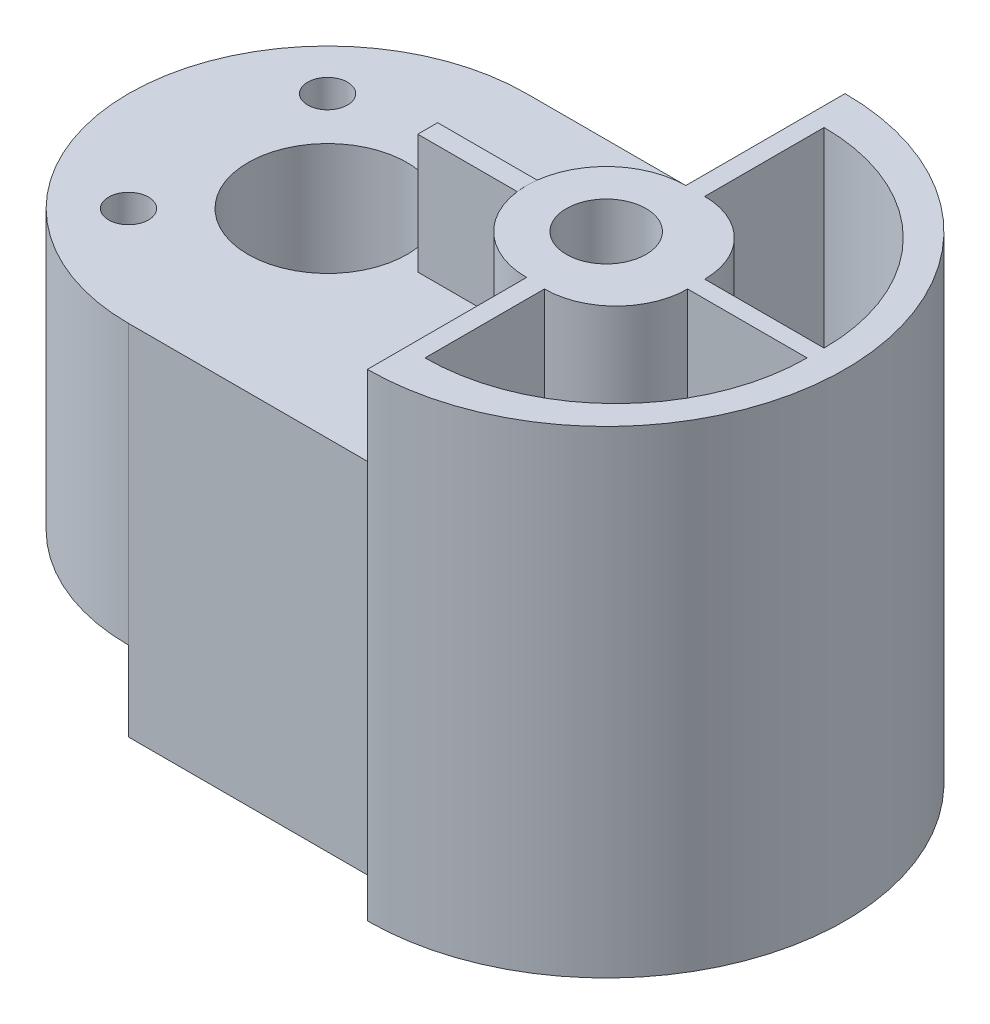
ISO-10303-21;
HEADER;
FILE_DESCRIPTION(('STEP AP214'),'2;1');
FILE_NAME('part.step','',(''),(''),'','','');
FILE_SCHEMA(('AUTOMOTIVE_DESIGN { 1 0 10303 214 1 1 1 1 }'));
ENDSEC;
DATA;
#1=APPLICATION_CONTEXT('core data for automotive mechanical design processes');
#2=APPLICATION_PROTOCOL_DEFINITION('international standard','automotive_design',2000,#1);
#3=PRODUCT_CONTEXT('',#1,'mechanical');
#4=PRODUCT('Part','Part','',(#3));
#5=PRODUCT_RELATED_PRODUCT_CATEGORY('part','',(#4));
#6=PRODUCT_DEFINITION_FORMATION('','',#4);
#7=PRODUCT_DEFINITION_CONTEXT('part definition',#1,'design');
#8=PRODUCT_DEFINITION('design','',#6,#7);
#9=PRODUCT_DEFINITION_SHAPE('','',#8);
#10=(LENGTH_UNIT() NAMED_UNIT(*) SI_UNIT(.MILLI.,.METRE.));
#11=(NAMED_UNIT(*) PLANE_ANGLE_UNIT() SI_UNIT($,.RADIAN.));
#12=(NAMED_UNIT(*) SI_UNIT($,.STERADIAN.) SOLID_ANGLE_UNIT());
#13=UNCERTAINTY_MEASURE_WITH_UNIT(LENGTH_MEASURE(1.E-05),#10,'distance_accuracy_value','');
#14=(GEOMETRIC_REPRESENTATION_CONTEXT(3) GLOBAL_UNCERTAINTY_ASSIGNED_CONTEXT((#13)) GLOBAL_UNIT_ASSIGNED_CONTEXT((#10,
#11,#12)) REPRESENTATION_CONTEXT('',''));
#15=CARTESIAN_POINT('',(0.,0.,0.));
#16=DIRECTION('',(0.,0.,1.));
#17=DIRECTION('',(1.,0.,0.));
#18=AXIS2_PLACEMENT_3D('',#15,#16,#17);
#19=CARTESIAN_POINT('',(50.,60.,-60.));
#20=DIRECTION('',(0.,1.,0.));
#21=DIRECTION('',(0.,0.,1.));
#22=AXIS2_PLACEMENT_3D('',#19,#20,#21);
#23=CYLINDRICAL_SURFACE('',#22,20.);
#24=CARTESIAN_POINT('',(50.,90.,-60.));
#25=DIRECTION('',(0.,1.,0.));
#26=DIRECTION('',(0.,0.,1.));
#27=AXIS2_PLACEMENT_3D('',#24,#25,#26);
#28=CIRCLE('',#27,20.);
#29=CARTESIAN_POINT('',(50.,90.,-40.));
#30=VERTEX_POINT('',#29);
#31=EDGE_CURVE('E255',#30,#30,#28,.T.);
#32=ORIENTED_EDGE('',*,*,#31,.T.);
#33=EDGE_LOOP('',(#32));
#34=FACE_BOUND('',#33,.T.);
#35=CARTESIAN_POINT('',(50.,40.,-60.));
#36=DIRECTION('',(0.,-1.,0.));
#37=DIRECTION('',(0.,0.,1.));
#38=AXIS2_PLACEMENT_3D('',#35,#36,#37);
#39=CIRCLE('',#38,20.);
#40=CARTESIAN_POINT('',(50.,40.,-40.));
#41=VERTEX_POINT('',#40);
#42=EDGE_CURVE('E241',#41,#41,#39,.T.);
#43=ORIENTED_EDGE('',*,*,#42,.T.);
#44=EDGE_LOOP('',(#43));
#45=FACE_BOUND('',#44,.T.);
#46=ADVANCED_FACE('F33',(#34,#45),#23,.F.);
#47=CARTESIAN_POINT('',(50.,0.,-60.));
#48=DIRECTION('',(0.,1.,0.));
#49=DIRECTION('',(0.,0.,1.));
#50=AXIS2_PLACEMENT_3D('',#47,#48,#49);
#51=CYLINDRICAL_SURFACE('',#50,50.);
#52=DIRECTION('',(0.,1.,0.));
#53=VECTOR('',#52,1.);
#54=CARTESIAN_POINT('',(50.,0.,-110.));
#55=LINE('',#54,#53);
#56=CARTESIAN_POINT('',(50.,20.,-110.));
#57=VERTEX_POINT('',#56);
#58=CARTESIAN_POINT('',(49.9999999999998,90.,-110.));
#59=VERTEX_POINT('',#58);
#60=EDGE_CURVE('E456',#57,#59,#55,.T.);
#61=ORIENTED_EDGE('',*,*,#60,.F.);
#62=CARTESIAN_POINT('',(50.,20.,-60.));
#63=DIRECTION('',(0.,-1.,0.));
#64=DIRECTION('',(0.,0.,-1.));
#65=AXIS2_PLACEMENT_3D('',#62,#63,#64);
#66=CIRCLE('',#65,50.);
#67=CARTESIAN_POINT('',(50.,20.,-10.));
#68=VERTEX_POINT('',#67);
#69=EDGE_CURVE('E228',#68,#57,#66,.T.);
#70=ORIENTED_EDGE('',*,*,#69,.F.);
#71=DIRECTION('',(0.,1.,0.));
#72=VECTOR('',#71,1.);
#73=CARTESIAN_POINT('',(50.,0.,-10.));
#74=LINE('',#73,#72);
#75=CARTESIAN_POINT('',(50.,90.,-10.));
#76=VERTEX_POINT('',#75);
#77=EDGE_CURVE('E451',#68,#76,#74,.T.);
#78=ORIENTED_EDGE('',*,*,#77,.T.);
#79=CARTESIAN_POINT('',(50.,90.,-60.));
#80=DIRECTION('',(0.,1.,0.));
#81=DIRECTION('',(0.,0.,1.));
#82=AXIS2_PLACEMENT_3D('',#79,#80,#81);
#83=CIRCLE('',#82,50.);
#84=EDGE_CURVE('E423',#59,#76,#83,.T.);
#85=ORIENTED_EDGE('',*,*,#84,.F.);
#86=EDGE_LOOP('',(#61,#70,#78,#85));
#87=FACE_BOUND('',#86,.T.);
#88=ADVANCED_FACE('F514',(#87),#51,.T.);
#89=CARTESIAN_POINT('',(25.,0.,-85.));
#90=DIRECTION('',(0.,1.,0.));
#91=DIRECTION('',(0.,0.,1.));
#92=AXIS2_PLACEMENT_3D('',#89,#90,#91);
#93=CYLINDRICAL_SURFACE('',#92,5.);
#94=CARTESIAN_POINT('',(25.,90.,-85.));
#95=DIRECTION('',(0.,-1.,0.));
#96=DIRECTION('',(0.,0.,-1.));
#97=AXIS2_PLACEMENT_3D('',#94,#95,#96);
#98=CIRCLE('',#97,5.);
#99=CARTESIAN_POINT('',(25.,90.,-90.));
#100=VERTEX_POINT('',#99);
#101=EDGE_CURVE('E444',#100,#100,#98,.F.);
#102=ORIENTED_EDGE('',*,*,#101,.T.);
#103=EDGE_LOOP('',(#102));
#104=FACE_BOUND('',#103,.T.);
#105=CARTESIAN_POINT('',(25.,20.,-85.));
#106=DIRECTION('',(0.,-1.,0.));
#107=DIRECTION('',(0.,0.,-1.));
#108=AXIS2_PLACEMENT_3D('',#105,#106,#107);
#109=CIRCLE('',#108,5.);
#110=CARTESIAN_POINT('',(25.,20.,-90.));
#111=VERTEX_POINT('',#110);
#112=EDGE_CURVE('E249',#111,#111,#109,.F.);
#113=ORIENTED_EDGE('',*,*,#112,.F.);
#114=EDGE_LOOP('',(#113));
#115=FACE_BOUND('',#114,.T.);
#116=ADVANCED_FACE('F569',(#104,#115),#93,.F.);
#117=CARTESIAN_POINT('',(25.,0.,-35.));
#118=DIRECTION('',(0.,1.,0.));
#119=DIRECTION('',(0.,0.,1.));
#120=AXIS2_PLACEMENT_3D('',#117,#118,#119);
#121=CYLINDRICAL_SURFACE('',#120,5.);
#122=CARTESIAN_POINT('',(25.,90.,-35.));
#123=DIRECTION('',(0.,-1.,0.));
#124=DIRECTION('',(0.,0.,-1.));
#125=AXIS2_PLACEMENT_3D('',#122,#123,#124);
#126=CIRCLE('',#125,5.);
#127=CARTESIAN_POINT('',(25.,90.,-40.));
#128=VERTEX_POINT('',#127);
#129=EDGE_CURVE('E440',#128,#128,#126,.F.);
#130=ORIENTED_EDGE('',*,*,#129,.T.);
#131=EDGE_LOOP('',(#130));
#132=FACE_BOUND('',#131,.T.);
#133=CARTESIAN_POINT('',(25.,20.,-35.));
#134=DIRECTION('',(0.,-1.,0.));
#135=DIRECTION('',(0.,0.,-1.));
#136=AXIS2_PLACEMENT_3D('',#133,#134,#135);
#137=CIRCLE('',#136,5.);
#138=CARTESIAN_POINT('',(25.,20.,-40.));
#139=VERTEX_POINT('',#138);
#140=EDGE_CURVE('E246',#139,#139,#137,.F.);
#141=ORIENTED_EDGE('',*,*,#140,.F.);
#142=EDGE_LOOP('',(#141));
#143=FACE_BOUND('',#142,.T.);
#144=ADVANCED_FACE('F625',(#132,#143),#121,.F.);
#145=CARTESIAN_POINT('',(110.,90.,-120.));
#146=DIRECTION('',(0.,-1.,0.));
#147=DIRECTION('',(0.,0.,-1.));
#148=AXIS2_PLACEMENT_3D('',#145,#146,#147);
#149=PLANE('',#148);
#150=ORIENTED_EDGE('',*,*,#31,.F.);
#151=EDGE_LOOP('',(#150));
#152=FACE_BOUND('',#151,.T.);
#153=ORIENTED_EDGE('',*,*,#129,.F.);
#154=EDGE_LOOP('',(#153));
#155=FACE_BOUND('',#154,.T.);
#156=ORIENTED_EDGE('',*,*,#101,.F.);
#157=EDGE_LOOP('',(#156));
#158=FACE_BOUND('',#157,.T.);
#159=DIRECTION('',(-1.,0.,0.));
#160=VECTOR('',#159,1.);
#161=CARTESIAN_POINT('',(100.156865167016,90.,-62.5));
#162=LINE('',#161,#160);
#163=CARTESIAN_POINT('',(100.156865167016,90.,-62.5));
#164=VERTEX_POINT('',#163);
#165=CARTESIAN_POINT('',(75.1568651670155,90.,-62.5));
#166=VERTEX_POINT('',#165);
#167=EDGE_CURVE('E258',#164,#166,#162,.T.);
#168=ORIENTED_EDGE('',*,*,#167,.F.);
#169=CARTESIAN_POINT('',(120.,90.,-60.));
#170=DIRECTION('',(0.,1.,0.));
#171=DIRECTION('',(0.,0.,1.));
#172=AXIS2_PLACEMENT_3D('',#169,#170,#171);
#173=CIRCLE('',#172,20.);
#174=CARTESIAN_POINT('',(120.,90.,-80.));
#175=VERTEX_POINT('',#174);
#176=EDGE_CURVE('E409',#175,#164,#173,.T.);
#177=ORIENTED_EDGE('',*,*,#176,.F.);
#178=DIRECTION('',(0.,0.,-1.));
#179=VECTOR('',#178,1.);
#180=CARTESIAN_POINT('',(120.,90.,-120.));
#181=LINE('',#180,#179);
#182=CARTESIAN_POINT('',(120.,90.,-120.));
#183=VERTEX_POINT('',#182);
#184=EDGE_CURVE('E430',#175,#183,#181,.T.);
#185=ORIENTED_EDGE('',*,*,#184,.T.);
#186=CARTESIAN_POINT('',(110.,90.,-120.));
#187=DIRECTION('',(0.,-1.,0.));
#188=DIRECTION('',(0.,0.,-1.));
#189=AXIS2_PLACEMENT_3D('',#186,#187,#188);
#190=CIRCLE('',#189,9.99999999999999);
#191=CARTESIAN_POINT('',(110.,90.,-110.));
#192=VERTEX_POINT('',#191);
#193=EDGE_CURVE('E417',#183,#192,#190,.T.);
#194=ORIENTED_EDGE('',*,*,#193,.T.);
#195=DIRECTION('',(-1.,0.,0.));
#196=VECTOR('',#195,1.);
#197=CARTESIAN_POINT('',(110.,90.,-110.));
#198=LINE('',#197,#196);
#199=EDGE_CURVE('E419',#192,#59,#198,.T.);
#200=ORIENTED_EDGE('',*,*,#199,.T.);
#201=ORIENTED_EDGE('',*,*,#84,.T.);
#202=DIRECTION('',(1.,0.,0.));
#203=VECTOR('',#202,1.);
#204=CARTESIAN_POINT('',(50.,90.,-10.));
#205=LINE('',#204,#203);
#206=CARTESIAN_POINT('',(110.,90.,-9.99999999999999));
#207=VERTEX_POINT('',#206);
#208=EDGE_CURVE('E426',#76,#207,#205,.T.);
#209=ORIENTED_EDGE('',*,*,#208,.T.);
#210=CARTESIAN_POINT('',(110.,90.,0.));
#211=DIRECTION('',(0.,-1.,0.));
#212=DIRECTION('',(0.,0.,-1.));
#213=AXIS2_PLACEMENT_3D('',#210,#211,#212);
#214=CIRCLE('',#213,9.99999999999999);
#215=CARTESIAN_POINT('',(120.,90.,0.));
#216=VERTEX_POINT('',#215);
#217=EDGE_CURVE('E428',#207,#216,#214,.T.);
#218=ORIENTED_EDGE('',*,*,#217,.T.);
#219=CARTESIAN_POINT('',(120.,90.,-40.));
#220=VERTEX_POINT('',#219);
#221=EDGE_CURVE('E431',#216,#220,#181,.T.);
#222=ORIENTED_EDGE('',*,*,#221,.T.);
#223=CARTESIAN_POINT('',(100.156865167016,90.,-57.5));
#224=VERTEX_POINT('',#223);
#225=EDGE_CURVE('E401',#224,#220,#173,.T.);
#226=ORIENTED_EDGE('',*,*,#225,.F.);
#227=DIRECTION('',(1.,0.,0.));
#228=VECTOR('',#227,1.);
#229=CARTESIAN_POINT('',(100.156865167016,90.,-57.5));
#230=LINE('',#229,#228);
#231=CARTESIAN_POINT('',(75.1568651670155,90.,-57.5));
#232=VERTEX_POINT('',#231);
#233=EDGE_CURVE('E262',#232,#224,#230,.T.);
#234=ORIENTED_EDGE('',*,*,#233,.F.);
#235=DIRECTION('',(0.,0.,1.));
#236=VECTOR('',#235,1.);
#237=CARTESIAN_POINT('',(75.1568651670155,90.,-62.5));
#238=LINE('',#237,#236);
#239=EDGE_CURVE('E270',#166,#232,#238,.T.);
#240=ORIENTED_EDGE('',*,*,#239,.F.);
#241=EDGE_LOOP('',(#168,#177,#185,#194,#200,#201,#209,#218,#222,#226,#234,#240));
#242=FACE_BOUND('',#241,.T.);
#243=ADVANCED_FACE('F517',(#152,#155,#158,#242),#149,.F.);
#244=CARTESIAN_POINT('',(120.,120.,-60.));
#245=DIRECTION('',(0.,-1.,0.));
#246=DIRECTION('',(0.,0.,-1.));
#247=AXIS2_PLACEMENT_3D('',#244,#245,#246);
#248=CYLINDRICAL_SURFACE('',#247,20.);
#249=DIRECTION('',(0.,-1.,0.));
#250=VECTOR('',#249,1.);
#251=CARTESIAN_POINT('',(100.156865167016,119.999,-62.5));
#252=LINE('',#251,#250);
#253=CARTESIAN_POINT('',(100.156865167016,119.999,-62.5));
#254=VERTEX_POINT('',#253);
#255=EDGE_CURVE('E282',#254,#164,#252,.T.);
#256=ORIENTED_EDGE('',*,*,#255,.F.);
#257=CARTESIAN_POINT('',(120.,119.999,-60.));
#258=DIRECTION('',(0.,-1.,0.));
#259=DIRECTION('',(0.,0.,-1.));
#260=AXIS2_PLACEMENT_3D('',#257,#258,#259);
#261=CIRCLE('',#260,20.);
#262=CARTESIAN_POINT('',(100.156865167016,119.999,-57.5));
#263=VERTEX_POINT('',#262);
#264=EDGE_CURVE('E11',#263,#254,#261,.T.);
#265=ORIENTED_EDGE('',*,*,#264,.F.);
#266=DIRECTION('',(0.,-1.,0.));
#267=VECTOR('',#266,1.);
#268=CARTESIAN_POINT('',(100.156865167016,119.999,-57.5));
#269=LINE('',#268,#267);
#270=EDGE_CURVE('E267',#263,#224,#269,.T.);
#271=ORIENTED_EDGE('',*,*,#270,.T.);
#272=ORIENTED_EDGE('',*,*,#225,.T.);
#273=DIRECTION('',(0.,-1.,0.));
#274=VECTOR('',#273,1.);
#275=CARTESIAN_POINT('',(120.,120.,-40.));
#276=LINE('',#275,#274);
#277=CARTESIAN_POINT('',(120.,120.,-40.));
#278=VERTEX_POINT('',#277);
#279=EDGE_CURVE('E413',#278,#220,#276,.T.);
#280=ORIENTED_EDGE('',*,*,#279,.F.);
#281=CARTESIAN_POINT('',(120.,120.,-60.));
#282=DIRECTION('',(0.,1.,0.));
#283=DIRECTION('',(0.,0.,1.));
#284=AXIS2_PLACEMENT_3D('',#281,#282,#283);
#285=CIRCLE('',#284,20.);
#286=CARTESIAN_POINT('',(120.,120.,-80.));
#287=VERTEX_POINT('',#286);
#288=EDGE_CURVE('E406',#287,#278,#285,.T.);
#289=ORIENTED_EDGE('',*,*,#288,.F.);
#290=DIRECTION('',(0.,-1.,0.));
#291=VECTOR('',#290,1.);
#292=CARTESIAN_POINT('',(120.,120.,-80.));
#293=LINE('',#292,#291);
#294=EDGE_CURVE('E408',#287,#175,#293,.T.);
#295=ORIENTED_EDGE('',*,*,#294,.T.);
#296=ORIENTED_EDGE('',*,*,#176,.T.);
#297=EDGE_LOOP('',(#256,#265,#271,#272,#280,#289,#295,#296));
#298=FACE_BOUND('',#297,.T.);
#299=ADVANCED_FACE('F548',(#298),#248,.T.);
#300=CARTESIAN_POINT('',(124.743133772041,60.,-57.7226784985936));
#301=DIRECTION('',(0.,-1.,0.));
#302=DIRECTION('',(0.,0.,-1.));
#303=AXIS2_PLACEMENT_3D('',#300,#301,#302);
#304=PLANE('',#303);
#305=CARTESIAN_POINT('',(124.743133772041,60.,-57.7226784985936));
#306=DIRECTION('',(0.,1.,0.));
#307=DIRECTION('',(0.,0.,1.));
#308=AXIS2_PLACEMENT_3D('',#305,#306,#307);
#309=CIRCLE('',#308,38.);
#310=CARTESIAN_POINT('',(124.743133772041,60.,-19.7226784985935));
#311=VERTEX_POINT('',#310);
#312=CARTESIAN_POINT('',(162.743133772042,60.,-57.7226784985936));
#313=VERTEX_POINT('',#312);
#314=EDGE_CURVE('E285',#311,#313,#309,.T.);
#315=ORIENTED_EDGE('',*,*,#314,.F.);
#316=DIRECTION('',(0.,0.,1.));
#317=VECTOR('',#316,1.);
#318=CARTESIAN_POINT('',(124.743133772041,60.,-39.7226784985936));
#319=LINE('',#318,#317);
#320=CARTESIAN_POINT('',(124.743133772041,60.,-9.72267849859358));
#321=VERTEX_POINT('',#320);
#322=EDGE_CURVE('E342',#311,#321,#319,.T.);
#323=ORIENTED_EDGE('',*,*,#322,.T.);
#324=CARTESIAN_POINT('',(124.743133772041,60.,-57.7226784985936));
#325=DIRECTION('',(0.,1.,0.));
#326=DIRECTION('',(0.,0.,1.));
#327=AXIS2_PLACEMENT_3D('',#324,#325,#326);
#328=CIRCLE('',#327,48.);
#329=CARTESIAN_POINT('',(172.743133772041,60.,-57.7226784985935));
#330=VERTEX_POINT('',#329);
#331=EDGE_CURVE('E341',#321,#330,#328,.T.);
#332=ORIENTED_EDGE('',*,*,#331,.T.);
#333=DIRECTION('',(-1.,0.,0.));
#334=VECTOR('',#333,1.);
#335=CARTESIAN_POINT('',(142.743133772042,60.,-57.7226784985936));
#336=LINE('',#335,#334);
#337=EDGE_CURVE('E307',#330,#313,#336,.T.);
#338=ORIENTED_EDGE('',*,*,#337,.T.);
#339=EDGE_LOOP('',(#315,#323,#332,#338));
#340=FACE_BOUND('',#339,.T.);
#341=ADVANCED_FACE('F586',(#340),#304,.F.);
#342=CARTESIAN_POINT('',(124.743133772041,60.,-62.));
#343=DIRECTION('',(0.,-1.,0.));
#344=DIRECTION('',(0.,0.,-1.));
#345=AXIS2_PLACEMENT_3D('',#342,#343,#344);
#346=PLANE('',#345);
#347=CARTESIAN_POINT('',(124.743133772041,60.,-62.));
#348=DIRECTION('',(0.,1.,0.));
#349=DIRECTION('',(0.,0.,-1.));
#350=AXIS2_PLACEMENT_3D('',#347,#348,#349);
#351=CIRCLE('',#350,38.);
#352=CARTESIAN_POINT('',(162.743133772041,60.,-62.));
#353=VERTEX_POINT('',#352);
#354=CARTESIAN_POINT('',(124.743133772041,60.,-100.));
#355=VERTEX_POINT('',#354);
#356=EDGE_CURVE('E314',#353,#355,#351,.T.);
#357=ORIENTED_EDGE('',*,*,#356,.F.);
#358=DIRECTION('',(1.,0.,0.));
#359=VECTOR('',#358,1.);
#360=CARTESIAN_POINT('',(142.743133772041,60.,-62.));
#361=LINE('',#360,#359);
#362=CARTESIAN_POINT('',(172.743133772041,60.,-62.));
#363=VERTEX_POINT('',#362);
#364=EDGE_CURVE('E372',#353,#363,#361,.T.);
#365=ORIENTED_EDGE('',*,*,#364,.T.);
#366=CARTESIAN_POINT('',(124.743133772041,60.,-62.));
#367=DIRECTION('',(0.,1.,0.));
#368=DIRECTION('',(0.,0.,-1.));
#369=AXIS2_PLACEMENT_3D('',#366,#367,#368);
#370=CIRCLE('',#369,48.);
#371=CARTESIAN_POINT('',(124.743133772041,60.,-110.));
#372=VERTEX_POINT('',#371);
#373=EDGE_CURVE('E377',#363,#372,#370,.T.);
#374=ORIENTED_EDGE('',*,*,#373,.T.);
#375=DIRECTION('',(0.,0.,1.));
#376=VECTOR('',#375,1.);
#377=CARTESIAN_POINT('',(124.743133772041,60.,-80.));
#378=LINE('',#377,#376);
#379=EDGE_CURVE('E329',#372,#355,#378,.T.);
#380=ORIENTED_EDGE('',*,*,#379,.T.);
#381=EDGE_LOOP('',(#357,#365,#374,#380));
#382=FACE_BOUND('',#381,.T.);
#383=ADVANCED_FACE('F589',(#382),#346,.F.);
#384=CARTESIAN_POINT('',(120.,90.,-120.));
#385=DIRECTION('',(1.,0.,0.));
#386=DIRECTION('',(0.,0.,-1.));
#387=AXIS2_PLACEMENT_3D('',#384,#385,#386);
#388=PLANE('',#387);
#389=ORIENTED_EDGE('',*,*,#294,.F.);
#390=DIRECTION('',(0.,0.,-1.));
#391=VECTOR('',#390,1.);
#392=CARTESIAN_POINT('',(120.,120.,-120.));
#393=LINE('',#392,#391);
#394=CARTESIAN_POINT('',(120.,120.,-120.));
#395=VERTEX_POINT('',#394);
#396=EDGE_CURVE('E416',#287,#395,#393,.T.);
#397=ORIENTED_EDGE('',*,*,#396,.T.);
#398=DIRECTION('',(0.,1.,0.));
#399=VECTOR('',#398,1.);
#400=CARTESIAN_POINT('',(120.,90.,-120.));
#401=LINE('',#400,#399);
#402=EDGE_CURVE('E437',#183,#395,#401,.T.);
#403=ORIENTED_EDGE('',*,*,#402,.F.);
#404=ORIENTED_EDGE('',*,*,#184,.F.);
#405=EDGE_LOOP('',(#389,#397,#403,#404));
#406=FACE_BOUND('',#405,.T.);
#407=ADVANCED_FACE('F523',(#406),#388,.F.);
#408=ORIENTED_EDGE('',*,*,#279,.T.);
#409=ORIENTED_EDGE('',*,*,#221,.F.);
#410=DIRECTION('',(0.,1.,0.));
#411=VECTOR('',#410,1.);
#412=CARTESIAN_POINT('',(120.,90.,0.));
#413=LINE('',#412,#411);
#414=CARTESIAN_POINT('',(120.,120.,0.));
#415=VERTEX_POINT('',#414);
#416=EDGE_CURVE('E434',#216,#415,#413,.T.);
#417=ORIENTED_EDGE('',*,*,#416,.T.);
#418=EDGE_CURVE('E420',#415,#278,#393,.T.);
#419=ORIENTED_EDGE('',*,*,#418,.T.);
#420=EDGE_LOOP('',(#408,#409,#417,#419));
#421=FACE_BOUND('',#420,.T.);
#422=ADVANCED_FACE('F532',(#421),#388,.F.);
#423=CARTESIAN_POINT('',(0.,120.,0.));
#424=DIRECTION('',(0.,-1.,0.));
#425=DIRECTION('',(0.,0.,-1.));
#426=AXIS2_PLACEMENT_3D('',#423,#424,#425);
#427=PLANE('',#426);
#428=DIRECTION('',(0.,0.,1.));
#429=VECTOR('',#428,1.);
#430=CARTESIAN_POINT('',(124.743133772041,120.,-39.7226784985936));
#431=LINE('',#430,#429);
#432=CARTESIAN_POINT('',(124.743133772041,120.,-39.7226784985936));
#433=VERTEX_POINT('',#432);
#434=CARTESIAN_POINT('',(124.743133772041,120.,-9.72267849859358));
#435=VERTEX_POINT('',#434);
#436=EDGE_CURVE('E353',#433,#435,#431,.T.);
#437=ORIENTED_EDGE('',*,*,#436,.F.);
#438=CARTESIAN_POINT('',(124.743133772041,120.,-57.7226784985936));
#439=DIRECTION('',(0.,-1.,0.));
#440=DIRECTION('',(0.,0.,-1.));
#441=AXIS2_PLACEMENT_3D('',#438,#439,#440);
#442=CIRCLE('',#441,18.);
#443=CARTESIAN_POINT('',(142.743133772042,120.,-57.7226784985936));
#444=VERTEX_POINT('',#443);
#445=EDGE_CURVE('E348',#444,#433,#442,.T.);
#446=ORIENTED_EDGE('',*,*,#445,.F.);
#447=DIRECTION('',(-1.,0.,0.));
#448=VECTOR('',#447,1.);
#449=CARTESIAN_POINT('',(142.743133772042,120.,-57.7226784985936));
#450=LINE('',#449,#448);
#451=CARTESIAN_POINT('',(172.743133772041,120.,-57.7226784985935));
#452=VERTEX_POINT('',#451);
#453=EDGE_CURVE('E344',#452,#444,#450,.T.);
#454=ORIENTED_EDGE('',*,*,#453,.F.);
#455=CARTESIAN_POINT('',(124.743133772041,120.,-57.7226784985936));
#456=DIRECTION('',(0.,1.,0.));
#457=DIRECTION('',(0.,0.,1.));
#458=AXIS2_PLACEMENT_3D('',#455,#456,#457);
#459=CIRCLE('',#458,48.);
#460=EDGE_CURVE('E663',#435,#452,#459,.T.);
#461=ORIENTED_EDGE('',*,*,#460,.F.);
#462=EDGE_LOOP('',(#437,#446,#454,#461));
#463=FACE_BOUND('',#462,.T.);
#464=DIRECTION('',(1.,0.,0.));
#465=VECTOR('',#464,1.);
#466=CARTESIAN_POINT('',(142.743133772041,120.,-62.));
#467=LINE('',#466,#465);
#468=CARTESIAN_POINT('',(142.743133772041,120.,-62.));
#469=VERTEX_POINT('',#468);
#470=CARTESIAN_POINT('',(172.743133772041,120.,-62.));
#471=VERTEX_POINT('',#470);
#472=EDGE_CURVE('E394',#469,#471,#467,.T.);
#473=ORIENTED_EDGE('',*,*,#472,.F.);
#474=CARTESIAN_POINT('',(124.743133772041,120.,-62.));
#475=DIRECTION('',(0.,-1.,0.));
#476=DIRECTION('',(0.,0.,-1.));
#477=AXIS2_PLACEMENT_3D('',#474,#475,#476);
#478=CIRCLE('',#477,18.);
#479=CARTESIAN_POINT('',(124.743133772041,120.,-80.));
#480=VERTEX_POINT('',#479);
#481=EDGE_CURVE('E392',#480,#469,#478,.T.);
#482=ORIENTED_EDGE('',*,*,#481,.F.);
#483=DIRECTION('',(0.,0.,1.));
#484=VECTOR('',#483,1.);
#485=CARTESIAN_POINT('',(124.743133772041,120.,-80.));
#486=LINE('',#485,#484);
#487=CARTESIAN_POINT('',(124.743133772041,120.,-110.));
#488=VERTEX_POINT('',#487);
#489=EDGE_CURVE('E378',#488,#480,#486,.T.);
#490=ORIENTED_EDGE('',*,*,#489,.F.);
#491=CARTESIAN_POINT('',(124.743133772041,120.,-62.));
#492=DIRECTION('',(0.,1.,0.));
#493=DIRECTION('',(0.,0.,-1.));
#494=AXIS2_PLACEMENT_3D('',#491,#492,#493);
#495=CIRCLE('',#494,48.);
#496=EDGE_CURVE('E381',#471,#488,#495,.T.);
#497=ORIENTED_EDGE('',*,*,#496,.F.);
#498=EDGE_LOOP('',(#473,#482,#490,#497));
#499=FACE_BOUND('',#498,.T.);
#500=ORIENTED_EDGE('',*,*,#396,.F.);
#501=ORIENTED_EDGE('',*,*,#288,.T.);
#502=ORIENTED_EDGE('',*,*,#418,.F.);
#503=CARTESIAN_POINT('',(120.,120.,-60.));
#504=DIRECTION('',(0.,1.,0.));
#505=DIRECTION('',(0.,0.,1.));
#506=AXIS2_PLACEMENT_3D('',#503,#504,#505);
#507=CIRCLE('',#506,60.);
#508=EDGE_CURVE('E460',#395,#415,#507,.F.);
#509=ORIENTED_EDGE('',*,*,#508,.F.);
#510=EDGE_LOOP('',(#500,#501,#502,#509));
#511=FACE_BOUND('',#510,.T.);
#512=CARTESIAN_POINT('',(120.,120.,-60.));
#513=DIRECTION('',(0.,1.,0.));
#514=DIRECTION('',(0.,0.,1.));
#515=AXIS2_PLACEMENT_3D('',#512,#513,#514);
#516=CIRCLE('',#515,9.99999999999999);
#517=CARTESIAN_POINT('',(120.,120.,-50.));
#518=VERTEX_POINT('',#517);
#519=EDGE_CURVE('E447',#518,#518,#516,.T.);
#520=ORIENTED_EDGE('',*,*,#519,.F.);
#521=EDGE_LOOP('',(#520));
#522=FACE_BOUND('',#521,.T.);
#523=ADVANCED_FACE('F528',(#463,#499,#511,#522),#427,.F.);
#524=CARTESIAN_POINT('',(0.,0.,0.));
#525=DIRECTION('',(0.,-1.,0.));
#526=DIRECTION('',(0.,0.,-1.));
#527=AXIS2_PLACEMENT_3D('',#524,#525,#526);
#528=PLANE('',#527);
#529=CARTESIAN_POINT('',(50.,0.,-60.));
#530=DIRECTION('',(0.,-1.,0.));
#531=DIRECTION('',(0.,0.,-1.));
#532=AXIS2_PLACEMENT_3D('',#529,#530,#531);
#533=CIRCLE('',#532,20.);
#534=CARTESIAN_POINT('',(49.9999999999999,0.,-80.));
#535=VERTEX_POINT('',#534);
#536=CARTESIAN_POINT('',(49.9999999999996,0.,-40.));
#537=VERTEX_POINT('',#536);
#538=EDGE_CURVE('E238',#535,#537,#533,.T.);
#539=ORIENTED_EDGE('',*,*,#538,.F.);
#540=DIRECTION('',(0.,0.,1.));
#541=VECTOR('',#540,1.);
#542=CARTESIAN_POINT('',(49.9999999999994,0.,2.60208521396518E-13));
#543=LINE('',#542,#541);
#544=CARTESIAN_POINT('',(50.,0.,-110.));
#545=VERTEX_POINT('',#544);
#546=EDGE_CURVE('E235',#545,#535,#543,.T.);
#547=ORIENTED_EDGE('',*,*,#546,.F.);
#548=DIRECTION('',(1.,0.,0.));
#549=VECTOR('',#548,1.);
#550=CARTESIAN_POINT('',(0.,0.,-110.));
#551=LINE('',#550,#549);
#552=CARTESIAN_POINT('',(110.,0.,-110.));
#553=VERTEX_POINT('',#552);
#554=EDGE_CURVE('E481',#545,#553,#551,.T.);
#555=ORIENTED_EDGE('',*,*,#554,.T.);
#556=CARTESIAN_POINT('',(110.,0.,-120.));
#557=DIRECTION('',(0.,1.,0.));
#558=DIRECTION('',(0.,0.,1.));
#559=AXIS2_PLACEMENT_3D('',#556,#557,#558);
#560=CIRCLE('',#559,9.99999999999999);
#561=CARTESIAN_POINT('',(120.,0.,-120.));
#562=VERTEX_POINT('',#561);
#563=EDGE_CURVE('E471',#553,#562,#560,.T.);
#564=ORIENTED_EDGE('',*,*,#563,.T.);
#565=CARTESIAN_POINT('',(120.,0.,-60.));
#566=DIRECTION('',(0.,1.,0.));
#567=DIRECTION('',(0.,0.,1.));
#568=AXIS2_PLACEMENT_3D('',#565,#566,#567);
#569=CIRCLE('',#568,60.);
#570=CARTESIAN_POINT('',(120.,0.,0.));
#571=VERTEX_POINT('',#570);
#572=EDGE_CURVE('E461',#562,#571,#569,.F.);
#573=ORIENTED_EDGE('',*,*,#572,.T.);
#574=CARTESIAN_POINT('',(110.,0.,0.));
#575=DIRECTION('',(0.,1.,0.));
#576=DIRECTION('',(0.,0.,-1.));
#577=AXIS2_PLACEMENT_3D('',#574,#575,#576);
#578=CIRCLE('',#577,10.);
#579=CARTESIAN_POINT('',(110.,0.,-10.));
#580=VERTEX_POINT('',#579);
#581=EDGE_CURVE('E463',#571,#580,#578,.T.);
#582=ORIENTED_EDGE('',*,*,#581,.T.);
#583=DIRECTION('',(-1.,0.,0.));
#584=VECTOR('',#583,1.);
#585=CARTESIAN_POINT('',(0.,0.,-10.));
#586=LINE('',#585,#584);
#587=CARTESIAN_POINT('',(50.,0.,-9.99999999999999));
#588=VERTEX_POINT('',#587);
#589=EDGE_CURVE('E477',#580,#588,#586,.T.);
#590=ORIENTED_EDGE('',*,*,#589,.T.);
#591=EDGE_CURVE('E250',#537,#588,#543,.T.);
#592=ORIENTED_EDGE('',*,*,#591,.F.);
#593=EDGE_LOOP('',(#539,#547,#555,#564,#573,#582,#590,#592));
#594=FACE_BOUND('',#593,.T.);
#595=CARTESIAN_POINT('',(124.743133772041,0.,-57.7226784985936));
#596=DIRECTION('',(0.,-1.,0.));
#597=DIRECTION('',(0.,0.,-1.));
#598=AXIS2_PLACEMENT_3D('',#595,#596,#597);
#599=CIRCLE('',#598,18.);
#600=CARTESIAN_POINT('',(142.743133772042,0.,-57.7226784985936));
#601=VERTEX_POINT('',#600);
#602=CARTESIAN_POINT('',(124.743133772041,0.,-39.7226784985936));
#603=VERTEX_POINT('',#602);
#604=EDGE_CURVE('E286',#601,#603,#599,.T.);
#605=ORIENTED_EDGE('',*,*,#604,.T.);
#606=DIRECTION('',(0.,0.,1.));
#607=VECTOR('',#606,1.);
#608=CARTESIAN_POINT('',(124.743133772041,0.,-39.7226784985936));
#609=LINE('',#608,#607);
#610=CARTESIAN_POINT('',(124.743133772041,0.,-19.7226784985935));
#611=VERTEX_POINT('',#610);
#612=EDGE_CURVE('E289',#603,#611,#609,.T.);
#613=ORIENTED_EDGE('',*,*,#612,.T.);
#614=CARTESIAN_POINT('',(124.743133772041,0.,-57.7226784985936));
#615=DIRECTION('',(0.,1.,0.));
#616=DIRECTION('',(0.,0.,1.));
#617=AXIS2_PLACEMENT_3D('',#614,#615,#616);
#618=CIRCLE('',#617,38.);
#619=CARTESIAN_POINT('',(162.743133772042,0.,-57.7226784985936));
#620=VERTEX_POINT('',#619);
#621=EDGE_CURVE('E292',#611,#620,#618,.T.);
#622=ORIENTED_EDGE('',*,*,#621,.T.);
#623=DIRECTION('',(-1.,0.,0.));
#624=VECTOR('',#623,1.);
#625=CARTESIAN_POINT('',(142.743133772042,0.,-57.7226784985936));
#626=LINE('',#625,#624);
#627=EDGE_CURVE('E295',#620,#601,#626,.T.);
#628=ORIENTED_EDGE('',*,*,#627,.T.);
#629=EDGE_LOOP('',(#605,#613,#622,#628));
#630=FACE_BOUND('',#629,.T.);
#631=CARTESIAN_POINT('',(124.743133772041,0.,-62.));
#632=DIRECTION('',(0.,-1.,0.));
#633=DIRECTION('',(0.,0.,-1.));
#634=AXIS2_PLACEMENT_3D('',#631,#632,#633);
#635=CIRCLE('',#634,18.);
#636=CARTESIAN_POINT('',(124.743133772041,0.,-80.));
#637=VERTEX_POINT('',#636);
#638=CARTESIAN_POINT('',(142.743133772041,0.,-62.));
#639=VERTEX_POINT('',#638);
#640=EDGE_CURVE('E301',#637,#639,#635,.T.);
#641=ORIENTED_EDGE('',*,*,#640,.T.);
#642=DIRECTION('',(1.,0.,0.));
#643=VECTOR('',#642,1.);
#644=CARTESIAN_POINT('',(142.743133772041,0.,-62.));
#645=LINE('',#644,#643);
#646=CARTESIAN_POINT('',(162.743133772041,0.,-62.));
#647=VERTEX_POINT('',#646);
#648=EDGE_CURVE('E325',#639,#647,#645,.T.);
#649=ORIENTED_EDGE('',*,*,#648,.T.);
#650=CARTESIAN_POINT('',(124.743133772041,0.,-62.));
#651=DIRECTION('',(0.,1.,0.));
#652=DIRECTION('',(0.,0.,-1.));
#653=AXIS2_PLACEMENT_3D('',#650,#651,#652);
#654=CIRCLE('',#653,38.);
#655=CARTESIAN_POINT('',(124.743133772041,0.,-100.));
#656=VERTEX_POINT('',#655);
#657=EDGE_CURVE('E357',#647,#656,#654,.T.);
#658=ORIENTED_EDGE('',*,*,#657,.T.);
#659=DIRECTION('',(0.,0.,1.));
#660=VECTOR('',#659,1.);
#661=CARTESIAN_POINT('',(124.743133772041,0.,-80.));
#662=LINE('',#661,#660);
#663=EDGE_CURVE('E337',#656,#637,#662,.T.);
#664=ORIENTED_EDGE('',*,*,#663,.T.);
#665=EDGE_LOOP('',(#641,#649,#658,#664));
#666=FACE_BOUND('',#665,.T.);
#667=CARTESIAN_POINT('',(120.,0.,-60.));
#668=DIRECTION('',(0.,1.,0.));
#669=DIRECTION('',(0.,0.,1.));
#670=AXIS2_PLACEMENT_3D('',#667,#668,#669);
#671=CIRCLE('',#670,9.99999999999999);
#672=CARTESIAN_POINT('',(120.,0.,-50.));
#673=VERTEX_POINT('',#672);
#674=EDGE_CURVE('E448',#673,#673,#671,.T.);
#675=ORIENTED_EDGE('',*,*,#674,.T.);
#676=EDGE_LOOP('',(#675));
#677=FACE_BOUND('',#676,.T.);
#678=ADVANCED_FACE('F35',(#594,#630,#666,#677),#528,.T.);
#679=CARTESIAN_POINT('',(0.,120.,-110.));
#680=DIRECTION('',(0.,0.,-1.));
#681=DIRECTION('',(-1.,0.,0.));
#682=AXIS2_PLACEMENT_3D('',#679,#680,#681);
#683=PLANE('',#682);
#684=ORIENTED_EDGE('',*,*,#199,.F.);
#685=DIRECTION('',(0.,-1.,0.));
#686=VECTOR('',#685,1.);
#687=CARTESIAN_POINT('',(110.,120.,-110.));
#688=LINE('',#687,#686);
#689=EDGE_CURVE('E41',#192,#553,#688,.T.);
#690=ORIENTED_EDGE('',*,*,#689,.T.);
#691=ORIENTED_EDGE('',*,*,#554,.F.);
#692=EDGE_CURVE('E457',#545,#57,#55,.T.);
#693=ORIENTED_EDGE('',*,*,#692,.T.);
#694=ORIENTED_EDGE('',*,*,#60,.T.);
#695=EDGE_LOOP('',(#684,#690,#691,#693,#694));
#696=FACE_BOUND('',#695,.T.);
#697=ADVANCED_FACE('F489',(#696),#683,.T.);
#698=CARTESIAN_POINT('',(0.,120.,-10.));
#699=DIRECTION('',(0.,0.,1.));
#700=DIRECTION('',(1.,0.,0.));
#701=AXIS2_PLACEMENT_3D('',#698,#699,#700);
#702=PLANE('',#701);
#703=ORIENTED_EDGE('',*,*,#208,.F.);
#704=ORIENTED_EDGE('',*,*,#77,.F.);
#705=EDGE_CURVE('E454',#588,#68,#74,.T.);
#706=ORIENTED_EDGE('',*,*,#705,.F.);
#707=ORIENTED_EDGE('',*,*,#589,.F.);
#708=DIRECTION('',(0.,-1.,0.));
#709=VECTOR('',#708,1.);
#710=CARTESIAN_POINT('',(110.,120.,-10.));
#711=LINE('',#710,#709);
#712=EDGE_CURVE('E480',#207,#580,#711,.T.);
#713=ORIENTED_EDGE('',*,*,#712,.F.);
#714=EDGE_LOOP('',(#703,#704,#706,#707,#713));
#715=FACE_BOUND('',#714,.T.);
#716=ADVANCED_FACE('F507',(#715),#702,.T.);
#717=CARTESIAN_POINT('',(110.,0.,-120.));
#718=DIRECTION('',(0.,1.,0.));
#719=DIRECTION('',(0.,0.,1.));
#720=AXIS2_PLACEMENT_3D('',#717,#718,#719);
#721=CYLINDRICAL_SURFACE('',#720,9.99999999999999);
#722=ORIENTED_EDGE('',*,*,#689,.F.);
#723=ORIENTED_EDGE('',*,*,#193,.F.);
#724=DIRECTION('',(0.,1.,0.));
#725=VECTOR('',#724,1.);
#726=CARTESIAN_POINT('',(120.,0.,-120.));
#727=LINE('',#726,#725);
#728=EDGE_CURVE('E474',#562,#183,#727,.T.);
#729=ORIENTED_EDGE('',*,*,#728,.F.);
#730=ORIENTED_EDGE('',*,*,#563,.F.);
#731=EDGE_LOOP('',(#722,#723,#729,#730));
#732=FACE_BOUND('',#731,.T.);
#733=ADVANCED_FACE('F492',(#732),#721,.F.);
#734=CARTESIAN_POINT('',(110.,0.,0.));
#735=DIRECTION('',(0.,1.,0.));
#736=DIRECTION('',(0.,0.,1.));
#737=AXIS2_PLACEMENT_3D('',#734,#735,#736);
#738=CYLINDRICAL_SURFACE('',#737,10.);
#739=DIRECTION('',(0.,1.,0.));
#740=VECTOR('',#739,1.);
#741=CARTESIAN_POINT('',(120.,0.,0.));
#742=LINE('',#741,#740);
#743=EDGE_CURVE('E468',#571,#216,#742,.T.);
#744=ORIENTED_EDGE('',*,*,#743,.T.);
#745=ORIENTED_EDGE('',*,*,#217,.F.);
#746=ORIENTED_EDGE('',*,*,#712,.T.);
#747=ORIENTED_EDGE('',*,*,#581,.F.);
#748=EDGE_LOOP('',(#744,#745,#746,#747));
#749=FACE_BOUND('',#748,.T.);
#750=ADVANCED_FACE('F503',(#749),#738,.F.);
#751=CARTESIAN_POINT('',(120.,0.,-60.));
#752=DIRECTION('',(0.,1.,0.));
#753=DIRECTION('',(0.,0.,1.));
#754=AXIS2_PLACEMENT_3D('',#751,#752,#753);
#755=CYLINDRICAL_SURFACE('',#754,60.);
#756=ORIENTED_EDGE('',*,*,#508,.T.);
#757=ORIENTED_EDGE('',*,*,#416,.F.);
#758=ORIENTED_EDGE('',*,*,#743,.F.);
#759=ORIENTED_EDGE('',*,*,#572,.F.);
#760=ORIENTED_EDGE('',*,*,#728,.T.);
#761=ORIENTED_EDGE('',*,*,#402,.T.);
#762=EDGE_LOOP('',(#756,#757,#758,#759,#760,#761));
#763=FACE_BOUND('',#762,.T.);
#764=ADVANCED_FACE('F500',(#763),#755,.T.);
#765=CARTESIAN_POINT('',(120.,0.,-60.));
#766=DIRECTION('',(0.,1.,0.));
#767=DIRECTION('',(0.,0.,1.));
#768=AXIS2_PLACEMENT_3D('',#765,#766,#767);
#769=CYLINDRICAL_SURFACE('',#768,9.99999999999999);
#770=ORIENTED_EDGE('',*,*,#519,.T.);
#771=EDGE_LOOP('',(#770));
#772=FACE_BOUND('',#771,.T.);
#773=ORIENTED_EDGE('',*,*,#674,.F.);
#774=EDGE_LOOP('',(#773));
#775=FACE_BOUND('',#774,.T.);
#776=ADVANCED_FACE('F619',(#772,#775),#769,.F.);
#777=CARTESIAN_POINT('',(124.743133772041,60.,-62.));
#778=DIRECTION('',(0.,1.,0.));
#779=DIRECTION('',(0.,0.,1.));
#780=AXIS2_PLACEMENT_3D('',#777,#778,#779);
#781=CYLINDRICAL_SURFACE('',#780,18.);
#782=ORIENTED_EDGE('',*,*,#481,.T.);
#783=DIRECTION('',(0.,1.,0.));
#784=VECTOR('',#783,1.);
#785=CARTESIAN_POINT('',(142.743133772041,60.,-62.));
#786=LINE('',#785,#784);
#787=EDGE_CURVE('E368',#639,#469,#786,.T.);
#788=ORIENTED_EDGE('',*,*,#787,.F.);
#789=ORIENTED_EDGE('',*,*,#640,.F.);
#790=DIRECTION('',(0.,1.,0.));
#791=VECTOR('',#790,1.);
#792=CARTESIAN_POINT('',(124.743133772041,60.,-80.));
#793=LINE('',#792,#791);
#794=EDGE_CURVE('E399',#637,#480,#793,.T.);
#795=ORIENTED_EDGE('',*,*,#794,.T.);
#796=EDGE_LOOP('',(#782,#788,#789,#795));
#797=FACE_BOUND('',#796,.T.);
#798=ADVANCED_FACE('F611',(#797),#781,.T.);
#799=CARTESIAN_POINT('',(124.743133772041,60.,-80.));
#800=DIRECTION('',(-1.,0.,0.));
#801=DIRECTION('',(0.,0.,1.));
#802=AXIS2_PLACEMENT_3D('',#799,#800,#801);
#803=PLANE('',#802);
#804=ORIENTED_EDGE('',*,*,#489,.T.);
#805=ORIENTED_EDGE('',*,*,#794,.F.);
#806=ORIENTED_EDGE('',*,*,#663,.F.);
#807=DIRECTION('',(0.,1.,0.));
#808=VECTOR('',#807,1.);
#809=CARTESIAN_POINT('',(124.743133772041,0.,-100.));
#810=LINE('',#809,#808);
#811=EDGE_CURVE('E347',#656,#355,#810,.T.);
#812=ORIENTED_EDGE('',*,*,#811,.T.);
#813=ORIENTED_EDGE('',*,*,#379,.F.);
#814=DIRECTION('',(0.,1.,0.));
#815=VECTOR('',#814,1.);
#816=CARTESIAN_POINT('',(124.743133772041,60.,-110.));
#817=LINE('',#816,#815);
#818=EDGE_CURVE('E402',#372,#488,#817,.T.);
#819=ORIENTED_EDGE('',*,*,#818,.T.);
#820=EDGE_LOOP('',(#804,#805,#806,#812,#813,#819));
#821=FACE_BOUND('',#820,.T.);
#822=ADVANCED_FACE('F607',(#821),#803,.F.);
#823=CARTESIAN_POINT('',(124.743133772041,60.,-62.));
#824=DIRECTION('',(0.,1.,0.));
#825=DIRECTION('',(0.,0.,1.));
#826=AXIS2_PLACEMENT_3D('',#823,#824,#825);
#827=CYLINDRICAL_SURFACE('',#826,48.);
#828=ORIENTED_EDGE('',*,*,#496,.T.);
#829=ORIENTED_EDGE('',*,*,#818,.F.);
#830=ORIENTED_EDGE('',*,*,#373,.F.);
#831=DIRECTION('',(0.,1.,0.));
#832=VECTOR('',#831,1.);
#833=CARTESIAN_POINT('',(172.743133772041,60.,-62.));
#834=LINE('',#833,#832);
#835=EDGE_CURVE('E373',#363,#471,#834,.T.);
#836=ORIENTED_EDGE('',*,*,#835,.T.);
#837=EDGE_LOOP('',(#828,#829,#830,#836));
#838=FACE_BOUND('',#837,.T.);
#839=ADVANCED_FACE('F610',(#838),#827,.F.);
#840=CARTESIAN_POINT('',(142.743133772041,60.,-62.));
#841=DIRECTION('',(0.,0.,1.));
#842=DIRECTION('',(1.,0.,0.));
#843=AXIS2_PLACEMENT_3D('',#840,#841,#842);
#844=PLANE('',#843);
#845=ORIENTED_EDGE('',*,*,#472,.T.);
#846=ORIENTED_EDGE('',*,*,#835,.F.);
#847=ORIENTED_EDGE('',*,*,#364,.F.);
#848=DIRECTION('',(0.,1.,0.));
#849=VECTOR('',#848,1.);
#850=CARTESIAN_POINT('',(162.743133772041,0.,-62.));
#851=LINE('',#850,#849);
#852=EDGE_CURVE('E332',#647,#353,#851,.T.);
#853=ORIENTED_EDGE('',*,*,#852,.F.);
#854=ORIENTED_EDGE('',*,*,#648,.F.);
#855=ORIENTED_EDGE('',*,*,#787,.T.);
#856=EDGE_LOOP('',(#845,#846,#847,#853,#854,#855));
#857=FACE_BOUND('',#856,.T.);
#858=ADVANCED_FACE('F367',(#857),#844,.F.);
#859=CARTESIAN_POINT('',(124.743133772041,60.,-57.7226784985936));
#860=DIRECTION('',(0.,1.,0.));
#861=DIRECTION('',(0.,0.,1.));
#862=AXIS2_PLACEMENT_3D('',#859,#860,#861);
#863=CYLINDRICAL_SURFACE('',#862,18.);
#864=ORIENTED_EDGE('',*,*,#445,.T.);
#865=DIRECTION('',(0.,1.,0.));
#866=VECTOR('',#865,1.);
#867=CARTESIAN_POINT('',(124.743133772041,60.,-39.7226784985936));
#868=LINE('',#867,#866);
#869=EDGE_CURVE('E388',#603,#433,#868,.T.);
#870=ORIENTED_EDGE('',*,*,#869,.F.);
#871=ORIENTED_EDGE('',*,*,#604,.F.);
#872=DIRECTION('',(0.,1.,0.));
#873=VECTOR('',#872,1.);
#874=CARTESIAN_POINT('',(142.743133772042,60.,-57.7226784985936));
#875=LINE('',#874,#873);
#876=EDGE_CURVE('E395',#601,#444,#875,.T.);
#877=ORIENTED_EDGE('',*,*,#876,.T.);
#878=EDGE_LOOP('',(#864,#870,#871,#877));
#879=FACE_BOUND('',#878,.T.);
#880=ADVANCED_FACE('F595',(#879),#863,.T.);
#881=CARTESIAN_POINT('',(142.743133772042,60.,-57.7226784985936));
#882=DIRECTION('',(0.,0.,-1.));
#883=DIRECTION('',(-1.,0.,0.));
#884=AXIS2_PLACEMENT_3D('',#881,#882,#883);
#885=PLANE('',#884);
#886=ORIENTED_EDGE('',*,*,#453,.T.);
#887=ORIENTED_EDGE('',*,*,#876,.F.);
#888=ORIENTED_EDGE('',*,*,#627,.F.);
#889=DIRECTION('',(0.,1.,0.));
#890=VECTOR('',#889,1.);
#891=CARTESIAN_POINT('',(162.743133772042,0.,-57.7226784985936));
#892=LINE('',#891,#890);
#893=EDGE_CURVE('E311',#620,#313,#892,.T.);
#894=ORIENTED_EDGE('',*,*,#893,.T.);
#895=ORIENTED_EDGE('',*,*,#337,.F.);
#896=DIRECTION('',(0.,1.,0.));
#897=VECTOR('',#896,1.);
#898=CARTESIAN_POINT('',(172.743133772041,60.,-57.7226784985935));
#899=LINE('',#898,#897);
#900=EDGE_CURVE('E672',#330,#452,#899,.T.);
#901=ORIENTED_EDGE('',*,*,#900,.T.);
#902=EDGE_LOOP('',(#886,#887,#888,#894,#895,#901));
#903=FACE_BOUND('',#902,.T.);
#904=ADVANCED_FACE('F591',(#903),#885,.F.);
#905=CARTESIAN_POINT('',(124.743133772041,60.,-57.7226784985936));
#906=DIRECTION('',(0.,1.,0.));
#907=DIRECTION('',(0.,0.,1.));
#908=AXIS2_PLACEMENT_3D('',#905,#906,#907);
#909=CYLINDRICAL_SURFACE('',#908,48.);
#910=ORIENTED_EDGE('',*,*,#460,.T.);
#911=ORIENTED_EDGE('',*,*,#900,.F.);
#912=ORIENTED_EDGE('',*,*,#331,.F.);
#913=DIRECTION('',(0.,1.,0.));
#914=VECTOR('',#913,1.);
#915=CARTESIAN_POINT('',(124.743133772041,60.,-9.72267849859358));
#916=LINE('',#915,#914);
#917=EDGE_CURVE('E673',#321,#435,#916,.T.);
#918=ORIENTED_EDGE('',*,*,#917,.T.);
#919=EDGE_LOOP('',(#910,#911,#912,#918));
#920=FACE_BOUND('',#919,.T.);
#921=ADVANCED_FACE('F594',(#920),#909,.F.);
#922=CARTESIAN_POINT('',(124.743133772041,60.,-39.7226784985936));
#923=DIRECTION('',(-1.,0.,0.));
#924=DIRECTION('',(0.,0.,1.));
#925=AXIS2_PLACEMENT_3D('',#922,#923,#924);
#926=PLANE('',#925);
#927=ORIENTED_EDGE('',*,*,#436,.T.);
#928=ORIENTED_EDGE('',*,*,#917,.F.);
#929=ORIENTED_EDGE('',*,*,#322,.F.);
#930=DIRECTION('',(0.,1.,0.));
#931=VECTOR('',#930,1.);
#932=CARTESIAN_POINT('',(124.743133772041,0.,-19.7226784985935));
#933=LINE('',#932,#931);
#934=EDGE_CURVE('E298',#611,#311,#933,.T.);
#935=ORIENTED_EDGE('',*,*,#934,.F.);
#936=ORIENTED_EDGE('',*,*,#612,.F.);
#937=ORIENTED_EDGE('',*,*,#869,.T.);
#938=EDGE_LOOP('',(#927,#928,#929,#935,#936,#937));
#939=FACE_BOUND('',#938,.T.);
#940=ADVANCED_FACE('F585',(#939),#926,.F.);
#941=CARTESIAN_POINT('',(124.743133772041,0.,-62.));
#942=DIRECTION('',(0.,1.,0.));
#943=DIRECTION('',(0.,0.,1.));
#944=AXIS2_PLACEMENT_3D('',#941,#942,#943);
#945=CYLINDRICAL_SURFACE('',#944,38.);
#946=ORIENTED_EDGE('',*,*,#356,.T.);
#947=ORIENTED_EDGE('',*,*,#811,.F.);
#948=ORIENTED_EDGE('',*,*,#657,.F.);
#949=ORIENTED_EDGE('',*,*,#852,.T.);
#950=EDGE_LOOP('',(#946,#947,#948,#949));
#951=FACE_BOUND('',#950,.T.);
#952=ADVANCED_FACE('F559',(#951),#945,.F.);
#953=CARTESIAN_POINT('',(124.743133772041,0.,-57.7226784985936));
#954=DIRECTION('',(0.,1.,0.));
#955=DIRECTION('',(0.,0.,1.));
#956=AXIS2_PLACEMENT_3D('',#953,#954,#955);
#957=CYLINDRICAL_SURFACE('',#956,38.);
#958=ORIENTED_EDGE('',*,*,#314,.T.);
#959=ORIENTED_EDGE('',*,*,#893,.F.);
#960=ORIENTED_EDGE('',*,*,#621,.F.);
#961=ORIENTED_EDGE('',*,*,#934,.T.);
#962=EDGE_LOOP('',(#958,#959,#960,#961));
#963=FACE_BOUND('',#962,.T.);
#964=ADVANCED_FACE('F552',(#963),#957,.F.);
#965=CARTESIAN_POINT('',(0.,119.999,0.));
#966=DIRECTION('',(0.,-1.,0.));
#967=DIRECTION('',(0.,0.,-1.));
#968=AXIS2_PLACEMENT_3D('',#965,#966,#967);
#969=PLANE('',#968);
#970=DIRECTION('',(1.,0.,0.));
#971=VECTOR('',#970,1.);
#972=CARTESIAN_POINT('',(100.156865167016,119.999,-57.5));
#973=LINE('',#972,#971);
#974=CARTESIAN_POINT('',(75.1568651670155,119.999,-57.5));
#975=VERTEX_POINT('',#974);
#976=EDGE_CURVE('E264',#975,#263,#973,.T.);
#977=ORIENTED_EDGE('',*,*,#976,.T.);
#978=ORIENTED_EDGE('',*,*,#264,.T.);
#979=DIRECTION('',(-1.,0.,0.));
#980=VECTOR('',#979,1.);
#981=CARTESIAN_POINT('',(100.156865167016,119.999,-62.5));
#982=LINE('',#981,#980);
#983=CARTESIAN_POINT('',(75.1568651670155,119.999,-62.5));
#984=VERTEX_POINT('',#983);
#985=EDGE_CURVE('E259',#254,#984,#982,.T.);
#986=ORIENTED_EDGE('',*,*,#985,.T.);
#987=DIRECTION('',(0.,0.,1.));
#988=VECTOR('',#987,1.);
#989=CARTESIAN_POINT('',(75.1568651670155,119.999,-62.5));
#990=LINE('',#989,#988);
#991=EDGE_CURVE('E261',#984,#975,#990,.T.);
#992=ORIENTED_EDGE('',*,*,#991,.T.);
#993=EDGE_LOOP('',(#977,#978,#986,#992));
#994=FACE_BOUND('',#993,.T.);
#995=ADVANCED_FACE('F550',(#994),#969,.F.);
#996=CARTESIAN_POINT('',(100.156865167016,119.999,-62.5));
#997=DIRECTION('',(0.,0.,1.));
#998=DIRECTION('',(1.,0.,0.));
#999=AXIS2_PLACEMENT_3D('',#996,#997,#998);
#1000=PLANE('',#999);
#1001=ORIENTED_EDGE('',*,*,#167,.T.);
#1002=DIRECTION('',(0.,-1.,0.));
#1003=VECTOR('',#1002,1.);
#1004=CARTESIAN_POINT('',(75.1568651670155,119.999,-62.5));
#1005=LINE('',#1004,#1003);
#1006=EDGE_CURVE('E279',#984,#166,#1005,.T.);
#1007=ORIENTED_EDGE('',*,*,#1006,.F.);
#1008=ORIENTED_EDGE('',*,*,#985,.F.);
#1009=ORIENTED_EDGE('',*,*,#255,.T.);
#1010=EDGE_LOOP('',(#1001,#1007,#1008,#1009));
#1011=FACE_BOUND('',#1010,.T.);
#1012=ADVANCED_FACE('F546',(#1011),#1000,.F.);
#1013=CARTESIAN_POINT('',(75.1568651670155,119.999,-62.5));
#1014=DIRECTION('',(1.,0.,0.));
#1015=DIRECTION('',(0.,0.,-1.));
#1016=AXIS2_PLACEMENT_3D('',#1013,#1014,#1015);
#1017=PLANE('',#1016);
#1018=ORIENTED_EDGE('',*,*,#239,.T.);
#1019=DIRECTION('',(0.,-1.,0.));
#1020=VECTOR('',#1019,1.);
#1021=CARTESIAN_POINT('',(75.1568651670155,119.999,-57.5));
#1022=LINE('',#1021,#1020);
#1023=EDGE_CURVE('E276',#975,#232,#1022,.T.);
#1024=ORIENTED_EDGE('',*,*,#1023,.F.);
#1025=ORIENTED_EDGE('',*,*,#991,.F.);
#1026=ORIENTED_EDGE('',*,*,#1006,.T.);
#1027=EDGE_LOOP('',(#1018,#1024,#1025,#1026));
#1028=FACE_BOUND('',#1027,.T.);
#1029=ADVANCED_FACE('F543',(#1028),#1017,.F.);
#1030=CARTESIAN_POINT('',(100.156865167016,119.999,-57.5));
#1031=DIRECTION('',(0.,0.,-1.));
#1032=DIRECTION('',(-1.,0.,0.));
#1033=AXIS2_PLACEMENT_3D('',#1030,#1031,#1032);
#1034=PLANE('',#1033);
#1035=ORIENTED_EDGE('',*,*,#233,.T.);
#1036=ORIENTED_EDGE('',*,*,#270,.F.);
#1037=ORIENTED_EDGE('',*,*,#976,.F.);
#1038=ORIENTED_EDGE('',*,*,#1023,.T.);
#1039=EDGE_LOOP('',(#1035,#1036,#1037,#1038));
#1040=FACE_BOUND('',#1039,.T.);
#1041=ADVANCED_FACE('F538',(#1040),#1034,.F.);
#1042=DIRECTION('',(0.,1.,0.));
#1043=VECTOR('',#1042,1.);
#1044=CARTESIAN_POINT('',(49.9999999999996,-24.4619732189471,-40.));
#1045=LINE('',#1044,#1043);
#1046=CARTESIAN_POINT('',(49.9999999999996,20.,-40.));
#1047=VERTEX_POINT('',#1046);
#1048=EDGE_CURVE('E48',#1047,#537,#1045,.F.);
#1049=ORIENTED_EDGE('',*,*,#1048,.F.);
#1050=CARTESIAN_POINT('',(50.,20.,-60.));
#1051=DIRECTION('',(0.,-1.,0.));
#1052=DIRECTION('',(0.,0.,-1.));
#1053=AXIS2_PLACEMENT_3D('',#1050,#1051,#1052);
#1054=CIRCLE('',#1053,20.);
#1055=CARTESIAN_POINT('',(50.0000000000002,20.,-80.));
#1056=VERTEX_POINT('',#1055);
#1057=EDGE_CURVE('E216',#1056,#1047,#1054,.T.);
#1058=ORIENTED_EDGE('',*,*,#1057,.F.);
#1059=DIRECTION('',(0.,1.,0.));
#1060=VECTOR('',#1059,1.);
#1061=CARTESIAN_POINT('',(49.9999999999999,-24.4619732189471,-80.));
#1062=LINE('',#1061,#1060);
#1063=EDGE_CURVE('E220',#535,#1056,#1062,.T.);
#1064=ORIENTED_EDGE('',*,*,#1063,.F.);
#1065=ORIENTED_EDGE('',*,*,#538,.T.);
#1066=EDGE_LOOP('',(#1049,#1058,#1064,#1065));
#1067=FACE_BOUND('',#1066,.T.);
#1068=ADVANCED_FACE('F218',(#1067),#23,.F.);
#1069=CARTESIAN_POINT('',(49.9999999999994,20.,2.60208521396518E-13));
#1070=DIRECTION('',(1.,0.,0.));
#1071=DIRECTION('',(0.,0.,-1.));
#1072=AXIS2_PLACEMENT_3D('',#1069,#1070,#1071);
#1073=PLANE('',#1072);
#1074=DIRECTION('',(0.,0.,1.));
#1075=VECTOR('',#1074,1.);
#1076=CARTESIAN_POINT('',(49.9999999999994,20.,2.60208521396518E-13));
#1077=LINE('',#1076,#1075);
#1078=EDGE_CURVE('E55',#1047,#68,#1077,.T.);
#1079=ORIENTED_EDGE('',*,*,#1078,.F.);
#1080=ORIENTED_EDGE('',*,*,#1048,.T.);
#1081=ORIENTED_EDGE('',*,*,#591,.T.);
#1082=ORIENTED_EDGE('',*,*,#705,.T.);
#1083=EDGE_LOOP('',(#1079,#1080,#1081,#1082));
#1084=FACE_BOUND('',#1083,.T.);
#1085=ADVANCED_FACE('F512',(#1084),#1073,.F.);
#1086=ORIENTED_EDGE('',*,*,#546,.T.);
#1087=ORIENTED_EDGE('',*,*,#1063,.T.);
#1088=EDGE_CURVE('E224',#57,#1056,#1077,.T.);
#1089=ORIENTED_EDGE('',*,*,#1088,.F.);
#1090=ORIENTED_EDGE('',*,*,#692,.F.);
#1091=EDGE_LOOP('',(#1086,#1087,#1089,#1090));
#1092=FACE_BOUND('',#1091,.T.);
#1093=ADVANCED_FACE('F233',(#1092),#1073,.F.);
#1094=CARTESIAN_POINT('',(0.,20.,0.));
#1095=DIRECTION('',(0.,-1.,0.));
#1096=DIRECTION('',(0.,0.,-1.));
#1097=AXIS2_PLACEMENT_3D('',#1094,#1095,#1096);
#1098=PLANE('',#1097);
#1099=ORIENTED_EDGE('',*,*,#1057,.T.);
#1100=ORIENTED_EDGE('',*,*,#1078,.T.);
#1101=ORIENTED_EDGE('',*,*,#69,.T.);
#1102=ORIENTED_EDGE('',*,*,#1088,.T.);
#1103=EDGE_LOOP('',(#1099,#1100,#1101,#1102));
#1104=FACE_BOUND('',#1103,.T.);
#1105=CARTESIAN_POINT('',(50.,20.,-60.));
#1106=DIRECTION('',(0.,1.,0.));
#1107=DIRECTION('',(0.,0.,1.));
#1108=AXIS2_PLACEMENT_3D('',#1105,#1106,#1107);
#1109=CIRCLE('',#1108,10.);
#1110=CARTESIAN_POINT('',(50.,20.,-50.));
#1111=VERTEX_POINT('',#1110);
#1112=EDGE_CURVE('E222',#1111,#1111,#1109,.T.);
#1113=ORIENTED_EDGE('',*,*,#1112,.T.);
#1114=EDGE_LOOP('',(#1113));
#1115=FACE_BOUND('',#1114,.T.);
#1116=ORIENTED_EDGE('',*,*,#140,.T.);
#1117=EDGE_LOOP('',(#1116));
#1118=FACE_BOUND('',#1117,.T.);
#1119=ORIENTED_EDGE('',*,*,#112,.T.);
#1120=EDGE_LOOP('',(#1119));
#1121=FACE_BOUND('',#1120,.T.);
#1122=ADVANCED_FACE('F225',(#1104,#1115,#1118,#1121),#1098,.T.);
#1123=CARTESIAN_POINT('',(50.,40.,-60.));
#1124=DIRECTION('',(0.,-1.,0.));
#1125=DIRECTION('',(0.,0.,-1.));
#1126=AXIS2_PLACEMENT_3D('',#1123,#1124,#1125);
#1127=CYLINDRICAL_SURFACE('',#1126,10.);
#1128=ORIENTED_EDGE('',*,*,#1112,.F.);
#1129=EDGE_LOOP('',(#1128));
#1130=FACE_BOUND('',#1129,.T.);
#1131=CARTESIAN_POINT('',(50.,40.,-60.));
#1132=DIRECTION('',(0.,1.,0.));
#1133=DIRECTION('',(0.,0.,1.));
#1134=AXIS2_PLACEMENT_3D('',#1131,#1132,#1133);
#1135=CIRCLE('',#1134,10.);
#1136=CARTESIAN_POINT('',(50.,40.,-50.));
#1137=VERTEX_POINT('',#1136);
#1138=EDGE_CURVE('E236',#1137,#1137,#1135,.T.);
#1139=ORIENTED_EDGE('',*,*,#1138,.T.);
#1140=EDGE_LOOP('',(#1139));
#1141=FACE_BOUND('',#1140,.T.);
#1142=ADVANCED_FACE('F750',(#1130,#1141),#1127,.F.);
#1143=CARTESIAN_POINT('',(50.,40.,-60.));
#1144=DIRECTION('',(0.,1.,0.));
#1145=DIRECTION('',(0.,0.,1.));
#1146=AXIS2_PLACEMENT_3D('',#1143,#1144,#1145);
#1147=PLANE('',#1146);
#1148=ORIENTED_EDGE('',*,*,#42,.F.);
#1149=EDGE_LOOP('',(#1148));
#1150=FACE_BOUND('',#1149,.T.);
#1151=ORIENTED_EDGE('',*,*,#1138,.F.);
#1152=EDGE_LOOP('',(#1151));
#1153=FACE_BOUND('',#1152,.T.);
#1154=ADVANCED_FACE('F936',(#1150,#1153),#1147,.T.);
#1155=CLOSED_SHELL('',(#46,#88,#116,#144,#243,#299,#341,#383,#407,#422,#523,#678,#697,#716,#733,
#750,#764,#776,#798,#822,#839,#858,#880,#904,#921,#940,#952,#964,#995,#1012,#1029,#1041,#1068,
#1085,#1093,#1122,#1142,#1154));
#1156=MANIFOLD_SOLID_BREP('B2',#1155);
#1157=ADVANCED_BREP_SHAPE_REPRESENTATION('',(#18,#1156),#14);
#1158=SHAPE_DEFINITION_REPRESENTATION(#9,#1157);
ENDSEC;
END-ISO-10303-21;
